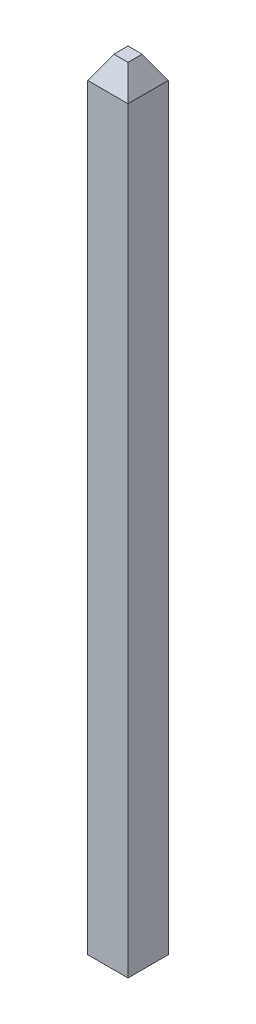
ISO-10303-21;
HEADER;
FILE_DESCRIPTION(('STEP AP214'),'2;1');
FILE_NAME('part.step','',(''),(''),'','','');
FILE_SCHEMA(('AUTOMOTIVE_DESIGN { 1 0 10303 214 1 1 1 1 }'));
ENDSEC;
DATA;
#1=APPLICATION_CONTEXT('core data for automotive mechanical design processes');
#2=APPLICATION_PROTOCOL_DEFINITION('international standard','automotive_design',2000,#1);
#3=PRODUCT_CONTEXT('',#1,'mechanical');
#4=PRODUCT('Part','Part','',(#3));
#5=PRODUCT_RELATED_PRODUCT_CATEGORY('part','',(#4));
#6=PRODUCT_DEFINITION_FORMATION('','',#4);
#7=PRODUCT_DEFINITION_CONTEXT('part definition',#1,'design');
#8=PRODUCT_DEFINITION('design','',#6,#7);
#9=PRODUCT_DEFINITION_SHAPE('','',#8);
#10=(LENGTH_UNIT() NAMED_UNIT(*) SI_UNIT(.MILLI.,.METRE.));
#11=(NAMED_UNIT(*) PLANE_ANGLE_UNIT() SI_UNIT($,.RADIAN.));
#12=(NAMED_UNIT(*) SI_UNIT($,.STERADIAN.) SOLID_ANGLE_UNIT());
#13=UNCERTAINTY_MEASURE_WITH_UNIT(LENGTH_MEASURE(1.E-05),#10,'distance_accuracy_value','');
#14=(GEOMETRIC_REPRESENTATION_CONTEXT(3) GLOBAL_UNCERTAINTY_ASSIGNED_CONTEXT((#13)) GLOBAL_UNIT_ASSIGNED_CONTEXT((#10,
#11,#12)) REPRESENTATION_CONTEXT('',''));
#15=CARTESIAN_POINT('',(0.,0.,0.));
#16=DIRECTION('',(0.,0.,1.));
#17=DIRECTION('',(1.,0.,0.));
#18=AXIS2_PLACEMENT_3D('',#15,#16,#17);
#19=CARTESIAN_POINT('',(41.105276717937,21.1582,-0.2032));
#20=DIRECTION('',(0.,0.,-1.));
#21=DIRECTION('',(0.,1.,0.));
#22=AXIS2_PLACEMENT_3D('',#19,#20,#21);
#23=PLANE('',#22);
#24=DIRECTION('',(0.,-1.,0.));
#25=VECTOR('',#24,1.);
#26=CARTESIAN_POINT('',(0.203199999999998,21.1582,-0.2032));
#27=LINE('',#26,#25);
#28=CARTESIAN_POINT('',(0.203199999999998,20.9296,-0.2032));
#29=VERTEX_POINT('',#28);
#30=CARTESIAN_POINT('',(0.203199999999997,13.3096,-0.2032));
#31=VERTEX_POINT('',#30);
#32=EDGE_CURVE('E76',#29,#31,#27,.T.);
#33=ORIENTED_EDGE('',*,*,#32,.T.);
#34=DIRECTION('',(-1.,0.,0.));
#35=VECTOR('',#34,1.);
#36=CARTESIAN_POINT('',(41.105276717937,13.3096,-0.2032));
#37=LINE('',#36,#35);
#38=CARTESIAN_POINT('',(-0.203200000000001,13.3096,-0.2032));
#39=VERTEX_POINT('',#38);
#40=EDGE_CURVE('E68',#31,#39,#37,.T.);
#41=ORIENTED_EDGE('',*,*,#40,.T.);
#42=DIRECTION('',(0.,-1.,0.));
#43=VECTOR('',#42,1.);
#44=CARTESIAN_POINT('',(-0.203200000000002,21.1582,-0.2032));
#45=LINE('',#44,#43);
#46=CARTESIAN_POINT('',(-0.203200000000002,20.9296,-0.2032));
#47=VERTEX_POINT('',#46);
#48=EDGE_CURVE('E73',#47,#39,#45,.T.);
#49=ORIENTED_EDGE('',*,*,#48,.F.);
#50=DIRECTION('',(1.,0.,0.));
#51=VECTOR('',#50,1.);
#52=CARTESIAN_POINT('',(0.203199999999998,20.9296,-0.2032));
#53=LINE('',#52,#51);
#54=EDGE_CURVE('E103',#47,#29,#53,.T.);
#55=ORIENTED_EDGE('',*,*,#54,.T.);
#56=EDGE_LOOP('',(#33,#41,#49,#55));
#57=FACE_BOUND('',#56,.T.);
#58=ADVANCED_FACE('F16',(#57),#23,.T.);
#59=CARTESIAN_POINT('',(41.105276717937,21.1582,0.2032));
#60=DIRECTION('',(0.,0.,-1.));
#61=DIRECTION('',(0.,1.,0.));
#62=AXIS2_PLACEMENT_3D('',#59,#60,#61);
#63=PLANE('',#62);
#64=DIRECTION('',(-1.,0.,0.));
#65=VECTOR('',#64,1.);
#66=CARTESIAN_POINT('',(41.105276717937,13.3096,0.2032));
#67=LINE('',#66,#65);
#68=CARTESIAN_POINT('',(0.203199999999997,13.3096,0.2032));
#69=VERTEX_POINT('',#68);
#70=CARTESIAN_POINT('',(-0.203200000000001,13.3096,0.2032));
#71=VERTEX_POINT('',#70);
#72=EDGE_CURVE('E30',#69,#71,#67,.T.);
#73=ORIENTED_EDGE('',*,*,#72,.F.);
#74=DIRECTION('',(0.,-1.,0.));
#75=VECTOR('',#74,1.);
#76=CARTESIAN_POINT('',(0.203199999999998,21.1582,0.2032));
#77=LINE('',#76,#75);
#78=CARTESIAN_POINT('',(0.203199999999998,20.9296,0.2032));
#79=VERTEX_POINT('',#78);
#80=EDGE_CURVE('E80',#79,#69,#77,.T.);
#81=ORIENTED_EDGE('',*,*,#80,.F.);
#82=DIRECTION('',(-1.,0.,0.));
#83=VECTOR('',#82,1.);
#84=CARTESIAN_POINT('',(41.105276717937,20.9296,0.2032));
#85=LINE('',#84,#83);
#86=CARTESIAN_POINT('',(-0.203200000000002,20.9296,0.2032));
#87=VERTEX_POINT('',#86);
#88=EDGE_CURVE('E23',#79,#87,#85,.T.);
#89=ORIENTED_EDGE('',*,*,#88,.T.);
#90=DIRECTION('',(0.,-1.,0.));
#91=VECTOR('',#90,1.);
#92=CARTESIAN_POINT('',(-0.203200000000002,21.1582,0.2032));
#93=LINE('',#92,#91);
#94=EDGE_CURVE('E81',#87,#71,#93,.T.);
#95=ORIENTED_EDGE('',*,*,#94,.T.);
#96=EDGE_LOOP('',(#73,#81,#89,#95));
#97=FACE_BOUND('',#96,.T.);
#98=ADVANCED_FACE('F107',(#97),#63,.F.);
#99=CARTESIAN_POINT('',(0.203199999999998,21.1582,-0.2032));
#100=DIRECTION('',(-1.,0.,0.));
#101=DIRECTION('',(0.,-1.,0.));
#102=AXIS2_PLACEMENT_3D('',#99,#100,#101);
#103=PLANE('',#102);
#104=DIRECTION('',(0.,0.,1.));
#105=VECTOR('',#104,1.);
#106=CARTESIAN_POINT('',(0.203199999999999,13.3096,-0.2032));
#107=LINE('',#106,#105);
#108=EDGE_CURVE('E77',#31,#69,#107,.T.);
#109=ORIENTED_EDGE('',*,*,#108,.F.);
#110=ORIENTED_EDGE('',*,*,#32,.F.);
#111=DIRECTION('',(0.,0.,1.));
#112=VECTOR('',#111,1.);
#113=CARTESIAN_POINT('',(0.203199999999998,20.9296,-0.2032));
#114=LINE('',#113,#112);
#115=EDGE_CURVE('E90',#29,#79,#114,.T.);
#116=ORIENTED_EDGE('',*,*,#115,.T.);
#117=ORIENTED_EDGE('',*,*,#80,.T.);
#118=EDGE_LOOP('',(#109,#110,#116,#117));
#119=FACE_BOUND('',#118,.T.);
#120=ADVANCED_FACE('F128',(#119),#103,.F.);
#121=CARTESIAN_POINT('',(-0.203200000000002,21.1582,-0.2032));
#122=DIRECTION('',(-1.,0.,0.));
#123=DIRECTION('',(0.,-1.,0.));
#124=AXIS2_PLACEMENT_3D('',#121,#122,#123);
#125=PLANE('',#124);
#126=ORIENTED_EDGE('',*,*,#48,.T.);
#127=DIRECTION('',(0.,0.,1.));
#128=VECTOR('',#127,1.);
#129=CARTESIAN_POINT('',(-0.203200000000001,13.3096,-0.2032));
#130=LINE('',#129,#128);
#131=EDGE_CURVE('E11',#39,#71,#130,.T.);
#132=ORIENTED_EDGE('',*,*,#131,.T.);
#133=ORIENTED_EDGE('',*,*,#94,.F.);
#134=DIRECTION('',(0.,0.,-1.));
#135=VECTOR('',#134,1.);
#136=CARTESIAN_POINT('',(-0.203200000000002,20.9296,-0.2032));
#137=LINE('',#136,#135);
#138=EDGE_CURVE('E37',#87,#47,#137,.T.);
#139=ORIENTED_EDGE('',*,*,#138,.T.);
#140=EDGE_LOOP('',(#126,#132,#133,#139));
#141=FACE_BOUND('',#140,.T.);
#142=ADVANCED_FACE('F79',(#141),#125,.T.);
#143=CARTESIAN_POINT('',(41.105276717937,21.1582,-0.2032));
#144=DIRECTION('',(0.,-1.,0.));
#145=DIRECTION('',(1.,0.,0.));
#146=AXIS2_PLACEMENT_3D('',#143,#144,#145);
#147=PLANE('',#146);
#148=DIRECTION('',(0.,0.,-1.));
#149=VECTOR('',#148,1.);
#150=CARTESIAN_POINT('',(0.0712177284632465,21.1582,-0.2032));
#151=LINE('',#150,#149);
#152=CARTESIAN_POINT('',(0.0712177284632468,21.1582,0.0712177284632491));
#153=VERTEX_POINT('',#152);
#154=CARTESIAN_POINT('',(0.0712177284632468,21.1582,-0.0712177284632491));
#155=VERTEX_POINT('',#154);
#156=EDGE_CURVE('E97',#153,#155,#151,.T.);
#157=ORIENTED_EDGE('',*,*,#156,.T.);
#158=DIRECTION('',(-1.,0.,0.));
#159=VECTOR('',#158,1.);
#160=CARTESIAN_POINT('',(-0.203200000000002,21.1582,-0.0712177284632491));
#161=LINE('',#160,#159);
#162=CARTESIAN_POINT('',(-0.0712177284632537,21.1582,-0.0712177284632491));
#163=VERTEX_POINT('',#162);
#164=EDGE_CURVE('E100',#155,#163,#161,.T.);
#165=ORIENTED_EDGE('',*,*,#164,.T.);
#166=DIRECTION('',(0.,0.,1.));
#167=VECTOR('',#166,1.);
#168=CARTESIAN_POINT('',(-0.0712177284632537,21.1582,0.2032));
#169=LINE('',#168,#167);
#170=CARTESIAN_POINT('',(-0.0712177284632537,21.1582,0.0712177284632491));
#171=VERTEX_POINT('',#170);
#172=EDGE_CURVE('E95',#163,#171,#169,.T.);
#173=ORIENTED_EDGE('',*,*,#172,.T.);
#174=DIRECTION('',(1.,0.,0.));
#175=VECTOR('',#174,1.);
#176=CARTESIAN_POINT('',(41.105276717937,21.1582,0.0712177284632491));
#177=LINE('',#176,#175);
#178=EDGE_CURVE('E93',#171,#153,#177,.T.);
#179=ORIENTED_EDGE('',*,*,#178,.T.);
#180=EDGE_LOOP('',(#157,#165,#173,#179));
#181=FACE_BOUND('',#180,.T.);
#182=ADVANCED_FACE('F136',(#181),#147,.F.);
#183=CARTESIAN_POINT('',(-0.0712177284632534,21.1582,-0.2032));
#184=DIRECTION('',(-0.866025403784441,0.499999999999996,0.));
#185=DIRECTION('',(-0.499999999999997,-0.866025403784441,0.));
#186=AXIS2_PLACEMENT_3D('',#183,#184,#185);
#187=PLANE('',#186);
#188=DIRECTION('',(0.447213595499954,0.774596669241483,-0.447213595499962));
#189=VECTOR('',#188,1.);
#190=CARTESIAN_POINT('',(8.05849534358724,35.2392760917485,-8.05849534358738));
#191=LINE('',#190,#189);
#192=EDGE_CURVE('E115',#171,#87,#191,.F.);
#193=ORIENTED_EDGE('',*,*,#192,.F.);
#194=ORIENTED_EDGE('',*,*,#172,.F.);
#195=DIRECTION('',(0.447213595499954,0.774596669241483,0.447213595499962));
#196=VECTOR('',#195,1.);
#197=CARTESIAN_POINT('',(8.16408116081663,35.4221560917485,8.16408116081679));
#198=LINE('',#197,#196);
#199=EDGE_CURVE('E85',#47,#163,#198,.T.);
#200=ORIENTED_EDGE('',*,*,#199,.F.);
#201=ORIENTED_EDGE('',*,*,#138,.F.);
#202=EDGE_LOOP('',(#193,#194,#200,#201));
#203=FACE_BOUND('',#202,.T.);
#204=ADVANCED_FACE('F113',(#203),#187,.T.);
#205=CARTESIAN_POINT('',(41.105276717937,21.1582,-0.0712177284632491));
#206=DIRECTION('',(0.,0.500000000000003,-0.866025403784437));
#207=DIRECTION('',(0.,0.866025403784437,0.500000000000003));
#208=AXIS2_PLACEMENT_3D('',#205,#206,#207);
#209=PLANE('',#208);
#210=ORIENTED_EDGE('',*,*,#199,.T.);
#211=ORIENTED_EDGE('',*,*,#164,.F.);
#212=DIRECTION('',(-0.447213595499962,0.77459666924148,0.44721359549996));
#213=VECTOR('',#212,1.);
#214=CARTESIAN_POINT('',(8.27802952635812,6.94358499789057,-8.27802952635809));
#215=LINE('',#214,#213);
#216=EDGE_CURVE('E120',#29,#155,#215,.T.);
#217=ORIENTED_EDGE('',*,*,#216,.F.);
#218=ORIENTED_EDGE('',*,*,#54,.F.);
#219=EDGE_LOOP('',(#210,#211,#217,#218));
#220=FACE_BOUND('',#219,.T.);
#221=ADVANCED_FACE('F138',(#220),#209,.T.);
#222=CARTESIAN_POINT('',(41.105276717937,20.9296,0.2032));
#223=DIRECTION('',(0.,-0.500000000000003,-0.866025403784437));
#224=DIRECTION('',(0.,0.866025403784437,-0.500000000000003));
#225=AXIS2_PLACEMENT_3D('',#222,#223,#224);
#226=PLANE('',#225);
#227=ORIENTED_EDGE('',*,*,#192,.T.);
#228=ORIENTED_EDGE('',*,*,#88,.F.);
#229=DIRECTION('',(-0.447213595499962,0.77459666924148,-0.44721359549996));
#230=VECTOR('',#229,1.);
#231=CARTESIAN_POINT('',(8.38361534358753,6.76070499789057,8.38361534358749));
#232=LINE('',#231,#230);
#233=EDGE_CURVE('E122',#153,#79,#232,.F.);
#234=ORIENTED_EDGE('',*,*,#233,.F.);
#235=ORIENTED_EDGE('',*,*,#178,.F.);
#236=EDGE_LOOP('',(#227,#228,#234,#235));
#237=FACE_BOUND('',#236,.T.);
#238=ADVANCED_FACE('F119',(#237),#226,.F.);
#239=CARTESIAN_POINT('',(0.203199999999998,20.9296,-0.2032));
#240=DIRECTION('',(-0.866025403784436,-0.500000000000005,0.));
#241=DIRECTION('',(0.500000000000005,-0.866025403784436,0.));
#242=AXIS2_PLACEMENT_3D('',#239,#240,#241);
#243=PLANE('',#242);
#244=ORIENTED_EDGE('',*,*,#216,.T.);
#245=ORIENTED_EDGE('',*,*,#156,.F.);
#246=ORIENTED_EDGE('',*,*,#233,.T.);
#247=ORIENTED_EDGE('',*,*,#115,.F.);
#248=EDGE_LOOP('',(#244,#245,#246,#247));
#249=FACE_BOUND('',#248,.T.);
#250=ADVANCED_FACE('F132',(#249),#243,.F.);
#251=CARTESIAN_POINT('',(-5.715,13.3096,-2.60408385953263));
#252=DIRECTION('',(0.,-1.,0.));
#253=DIRECTION('',(0.,0.,-1.));
#254=AXIS2_PLACEMENT_3D('',#251,#252,#253);
#255=PLANE('',#254);
#256=ORIENTED_EDGE('',*,*,#108,.T.);
#257=ORIENTED_EDGE('',*,*,#72,.T.);
#258=ORIENTED_EDGE('',*,*,#131,.F.);
#259=ORIENTED_EDGE('',*,*,#40,.F.);
#260=EDGE_LOOP('',(#256,#257,#258,#259));
#261=FACE_BOUND('',#260,.T.);
#262=ADVANCED_FACE('F67',(#261),#255,.T.);
#263=CLOSED_SHELL('',(#58,#98,#120,#142,#182,#204,#221,#238,#250,#262));
#264=MANIFOLD_SOLID_BREP('B1',#263);
#265=ADVANCED_BREP_SHAPE_REPRESENTATION('',(#18,#264),#14);
#266=SHAPE_DEFINITION_REPRESENTATION(#9,#265);
ENDSEC;
END-ISO-10303-21;
